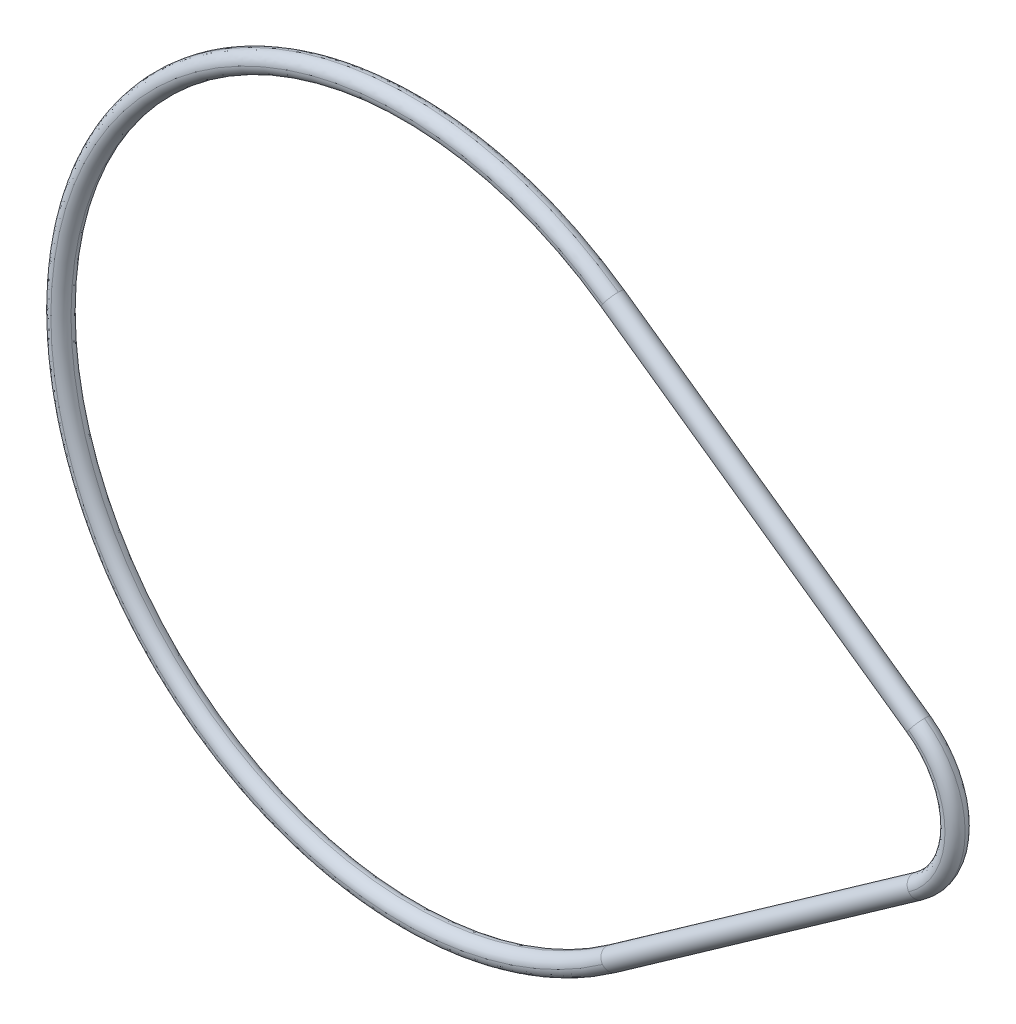
ISO-10303-21;
HEADER;
FILE_DESCRIPTION(('STEP AP214'),'2;1');
FILE_NAME('part.step','',(''),(''),'','','');
FILE_SCHEMA(('AUTOMOTIVE_DESIGN { 1 0 10303 214 1 1 1 1 }'));
ENDSEC;
DATA;
#1=APPLICATION_CONTEXT('core data for automotive mechanical design processes');
#2=APPLICATION_PROTOCOL_DEFINITION('international standard','automotive_design',2000,#1);
#3=PRODUCT_CONTEXT('',#1,'mechanical');
#4=PRODUCT('Part','Part','',(#3));
#5=PRODUCT_RELATED_PRODUCT_CATEGORY('part','',(#4));
#6=PRODUCT_DEFINITION_FORMATION('','',#4);
#7=PRODUCT_DEFINITION_CONTEXT('part definition',#1,'design');
#8=PRODUCT_DEFINITION('design','',#6,#7);
#9=PRODUCT_DEFINITION_SHAPE('','',#8);
#10=(LENGTH_UNIT() NAMED_UNIT(*) SI_UNIT(.MILLI.,.METRE.));
#11=(NAMED_UNIT(*) PLANE_ANGLE_UNIT() SI_UNIT($,.RADIAN.));
#12=(NAMED_UNIT(*) SI_UNIT($,.STERADIAN.) SOLID_ANGLE_UNIT());
#13=UNCERTAINTY_MEASURE_WITH_UNIT(LENGTH_MEASURE(1.E-05),#10,'distance_accuracy_value','');
#14=(GEOMETRIC_REPRESENTATION_CONTEXT(3) GLOBAL_UNCERTAINTY_ASSIGNED_CONTEXT((#13)) GLOBAL_UNIT_ASSIGNED_CONTEXT((#10,
#11,#12)) REPRESENTATION_CONTEXT('',''));
#15=CARTESIAN_POINT('',(0.,0.,0.));
#16=DIRECTION('',(0.,0.,1.));
#17=DIRECTION('',(1.,0.,0.));
#18=AXIS2_PLACEMENT_3D('',#15,#16,#17);
#19=CARTESIAN_POINT('',(35.9999999999998,-4.35415592470179E-13,4.42337322807909E-13));
#20=CARTESIAN_POINT('',(35.9999999999998,-4.3545146154447E-13,0.585786437627345));
#21=CARTESIAN_POINT('',(36.4142135623729,-4.35476824810136E-13,1.00000000000044));
#22=CARTESIAN_POINT('',(36.9999999999998,-4.35476824810136E-13,1.00000000000044));
#23=(BOUNDED_CURVE() B_SPLINE_CURVE(3,(#19,#20,#21,#22),.UNSPECIFIED.,.F.,
.F.) B_SPLINE_CURVE_WITH_KNOTS((4,4),(0.,1.),
.UNSPECIFIED.) CURVE() GEOMETRIC_REPRESENTATION_ITEM() RATIONAL_B_SPLINE_CURVE((1.,
0.804737854124367,0.804737854124367,1.)) REPRESENTATION_ITEM(''));
#24=CARTESIAN_POINT('',(45.5,0.,0.));
#25=DIRECTION('',(0.,0.,-1.));
#26=AXIS1_PLACEMENT('',#24,#25);
#27=SURFACE_OF_REVOLUTION('',#23,#26);
#28=CARTESIAN_POINT('',(45.5,0.,-1.92030235675099E-13));
#29=DIRECTION('',(0.,0.,-1.));
#30=DIRECTION('',(-1.,0.,0.));
#31=AXIS2_PLACEMENT_3D('',#28,#29,#30);
#32=CIRCLE('',#31,9.5000000000006);
#33=CARTESIAN_POINT('',(50.9755494585221,7.76326980929782,0.));
#34=VERTEX_POINT('',#33);
#35=CARTESIAN_POINT('',(50.975549450689,-7.76326981466686,0.));
#36=VERTEX_POINT('',#35);
#37=EDGE_CURVE('E233',#34,#36,#32,.T.);
#38=ORIENTED_EDGE('',*,*,#37,.F.);
#39=CARTESIAN_POINT('',(50.3991758241761,6.94608351834409,4.37540678464507E-13));
#40=DIRECTION('',(0.817186296275724,-0.576373626373696,0.));
#41=DIRECTION('',(0.576373626373693,0.817186296275726,0.));
#42=AXIS2_PLACEMENT_3D('',#39,#40,#41);
#43=CIRCLE('',#42,1.);
#44=CARTESIAN_POINT('',(50.3991758271894,6.94608351597871,1.00000000009366));
#45=VERTEX_POINT('',#44);
#46=EDGE_CURVE('E114',#34,#45,#43,.T.);
#47=ORIENTED_EDGE('',*,*,#46,.T.);
#48=CARTESIAN_POINT('',(45.5,0.,1.));
#49=DIRECTION('',(0.,0.,-1.));
#50=DIRECTION('',(-1.,0.,0.));
#51=AXIS2_PLACEMENT_3D('',#48,#49,#50);
#52=CIRCLE('',#51,8.49999999999956);
#53=CARTESIAN_POINT('',(50.3991758241891,-6.94608351821187,1.00000000004481));
#54=VERTEX_POINT('',#53);
#55=EDGE_CURVE('E126',#54,#45,#52,.F.);
#56=ORIENTED_EDGE('',*,*,#55,.F.);
#57=CARTESIAN_POINT('',(50.3991758241755,-6.94608351834449,4.4109038795075E-13));
#58=DIRECTION('',(0.817186296275836,0.576373626373538,0.));
#59=DIRECTION('',(0.576373626373541,-0.817186296275833,0.));
#60=AXIS2_PLACEMENT_3D('',#57,#58,#59);
#61=CIRCLE('',#60,0.999999999999998);
#62=EDGE_CURVE('E111',#54,#36,#61,.T.);
#63=ORIENTED_EDGE('',*,*,#62,.T.);
#64=EDGE_LOOP('',(#38,#47,#56,#63));
#65=FACE_BOUND('',#64,.T.);
#66=ADVANCED_FACE('F16',(#65),#27,.F.);
#67=CARTESIAN_POINT('',(20.014574175452,28.3767941383865,0.));
#68=DIRECTION('',(-0.817186296275671,0.576373626373771,0.));
#69=DIRECTION('',(-0.576373626373771,-0.817186296275671,0.));
#70=AXIS2_PLACEMENT_3D('',#67,#68,#69);
#71=CYLINDRICAL_SURFACE('',#70,1.00000000001412);
#72=CARTESIAN_POINT('',(20.0145741757996,28.3767941381413,0.));
#73=DIRECTION('',(-0.817186296275672,0.576373626373769,0.));
#74=DIRECTION('',(-0.57637362637377,-0.817186296275672,0.));
#75=AXIS2_PLACEMENT_3D('',#72,#73,#74);
#76=CIRCLE('',#75,1.00000000013567);
#77=CARTESIAN_POINT('',(20.01457417573,28.3767941379995,0.999999999957661));
#78=VERTEX_POINT('',#77);
#79=CARTESIAN_POINT('',(19.4382005494769,27.5596078418945,0.));
#80=VERTEX_POINT('',#79);
#81=EDGE_CURVE('E88',#78,#80,#76,.F.);
#82=ORIENTED_EDGE('',*,*,#81,.T.);
#83=CARTESIAN_POINT('',(20.0145741758809,28.376794138084,0.));
#84=DIRECTION('',(0.817186296276143,-0.576373626373101,0.));
#85=DIRECTION('',(0.5763736263731,0.817186296276144,0.));
#86=AXIS2_PLACEMENT_3D('',#83,#84,#85);
#87=CIRCLE('',#86,0.999999999559293);
#88=CARTESIAN_POINT('',(20.0145741757953,28.3767941380489,-0.999999999813564));
#89=VERTEX_POINT('',#88);
#90=EDGE_CURVE('E100',#80,#89,#87,.T.);
#91=ORIENTED_EDGE('',*,*,#90,.T.);
#92=CARTESIAN_POINT('',(20.0145741758243,28.3767941381762,0.));
#93=DIRECTION('',(-0.817186296275768,0.576373626373633,0.));
#94=DIRECTION('',(0.,0.,-1.));
#95=AXIS2_PLACEMENT_3D('',#92,#93,#94);
#96=CIRCLE('',#95,1.00000000000001);
#97=CARTESIAN_POINT('',(20.5909478021124,29.193980434245,0.));
#98=VERTEX_POINT('',#97);
#99=EDGE_CURVE('E234',#98,#89,#96,.T.);
#100=ORIENTED_EDGE('',*,*,#99,.F.);
#101=CARTESIAN_POINT('',(20.0145741758809,28.376794138084,0.));
#102=DIRECTION('',(0.817186296276143,-0.576373626373101,0.));
#103=DIRECTION('',(0.5763736263731,0.817186296276144,0.));
#104=AXIS2_PLACEMENT_3D('',#101,#102,#103);
#105=CIRCLE('',#104,0.999999999559293);
#106=EDGE_CURVE('E103',#98,#78,#105,.T.);
#107=ORIENTED_EDGE('',*,*,#106,.T.);
#108=EDGE_LOOP('',(#82,#91,#100,#107));
#109=FACE_BOUND('',#108,.T.);
#110=CARTESIAN_POINT('',(50.3991758119882,6.94608352691719,0.));
#111=DIRECTION('',(0.817186296276143,-0.576373626373101,0.));
#112=DIRECTION('',(0.5763736263731,0.817186296276144,0.));
#113=AXIS2_PLACEMENT_3D('',#110,#111,#112);
#114=CIRCLE('',#113,1.00000000058911);
#115=CARTESIAN_POINT('',(50.3991758195627,6.94608352141083,-1.00000000026774));
#116=VERTEX_POINT('',#115);
#117=CARTESIAN_POINT('',(49.8228021947695,6.12889722405691,0.));
#118=VERTEX_POINT('',#117);
#119=EDGE_CURVE('E105',#116,#118,#114,.F.);
#120=ORIENTED_EDGE('',*,*,#119,.T.);
#121=CARTESIAN_POINT('',(50.3991758243119,6.94608351818795,0.));
#122=DIRECTION('',(-0.817186296275672,0.576373626373769,0.));
#123=DIRECTION('',(-0.576373626373767,-0.817186296275674,0.));
#124=AXIS2_PLACEMENT_3D('',#121,#122,#123);
#125=CIRCLE('',#124,0.999999999892656);
#126=EDGE_CURVE('E20',#118,#45,#125,.T.);
#127=ORIENTED_EDGE('',*,*,#126,.T.);
#128=ORIENTED_EDGE('',*,*,#46,.F.);
#129=CARTESIAN_POINT('',(50.3991758363535,6.94608350975573,-1.89672817258016E-13));
#130=DIRECTION('',(0.817186295265293,-0.576373627806292,0.));
#131=DIRECTION('',(0.,0.,-1.));
#132=AXIS2_PLACEMENT_3D('',#129,#130,#131);
#133=CIRCLE('',#132,1.);
#134=EDGE_CURVE('E230',#116,#34,#133,.T.);
#135=ORIENTED_EDGE('',*,*,#134,.F.);
#136=EDGE_LOOP('',(#120,#127,#128,#135));
#137=FACE_BOUND('',#136,.T.);
#138=ADVANCED_FACE('F97',(#109,#137),#71,.T.);
#139=CARTESIAN_POINT('',(37.0000000000004,-4.35476824810136E-13,1.));
#140=CARTESIAN_POINT('',(37.5857864376273,-4.35476824810136E-13,0.999999999999992));
#141=CARTESIAN_POINT('',(38.0000000000004,-4.3545146154447E-13,0.585786437626891));
#142=CARTESIAN_POINT('',(38.0000000000004,-4.35415592470179E-13,0.));
#143=(BOUNDED_CURVE() B_SPLINE_CURVE(3,(#139,#140,#141,#142),.UNSPECIFIED.,.F.,
.F.) B_SPLINE_CURVE_WITH_KNOTS((4,4),(0.,1.),
.UNSPECIFIED.) CURVE() GEOMETRIC_REPRESENTATION_ITEM() RATIONAL_B_SPLINE_CURVE((1.,
0.804737854124365,0.804737854124365,1.)) REPRESENTATION_ITEM(''));
#144=CARTESIAN_POINT('',(45.5,0.,0.));
#145=DIRECTION('',(0.,0.,-1.));
#146=AXIS1_PLACEMENT('',#144,#145);
#147=SURFACE_OF_REVOLUTION('',#143,#146);
#148=ORIENTED_EDGE('',*,*,#55,.T.);
#149=ORIENTED_EDGE('',*,*,#126,.F.);
#150=CARTESIAN_POINT('',(45.5,0.,0.));
#151=DIRECTION('',(0.,0.,-1.));
#152=DIRECTION('',(-1.,0.,0.));
#153=AXIS2_PLACEMENT_3D('',#150,#151,#152);
#154=CIRCLE('',#153,7.5);
#155=CARTESIAN_POINT('',(49.8228022004797,-6.12889722008621,0.));
#156=VERTEX_POINT('',#155);
#157=EDGE_CURVE('E228',#156,#118,#154,.F.);
#158=ORIENTED_EDGE('',*,*,#157,.F.);
#159=CARTESIAN_POINT('',(50.3991758241751,-6.94608351834404,0.));
#160=DIRECTION('',(0.817186296275848,0.576373626373521,0.));
#161=DIRECTION('',(0.,0.,1.));
#162=AXIS2_PLACEMENT_3D('',#159,#160,#161);
#163=CIRCLE('',#162,0.999999999999997);
#164=EDGE_CURVE('E116',#156,#54,#163,.T.);
#165=ORIENTED_EDGE('',*,*,#164,.T.);
#166=EDGE_LOOP('',(#148,#149,#158,#165));
#167=FACE_BOUND('',#166,.T.);
#168=ADVANCED_FACE('F138',(#167),#147,.F.);
#169=CARTESIAN_POINT('',(36.9999999999994,-4.35354360130221E-13,-1.00000000000019));
#170=CARTESIAN_POINT('',(36.4142135623725,-4.35354360130221E-13,-1.00000000000019));
#171=CARTESIAN_POINT('',(35.9999999999994,-4.35379723395887E-13,-0.585786437627097));
#172=CARTESIAN_POINT('',(35.9999999999994,-4.35415592470178E-13,-1.92030235675099E-13));
#173=(BOUNDED_CURVE() B_SPLINE_CURVE(3,(#169,#170,#171,#172),.UNSPECIFIED.,.F.,
.F.) B_SPLINE_CURVE_WITH_KNOTS((4,4),(0.,1.),
.UNSPECIFIED.) CURVE() GEOMETRIC_REPRESENTATION_ITEM() RATIONAL_B_SPLINE_CURVE((1.,
0.804737854124365,0.804737854124365,1.)) REPRESENTATION_ITEM(''));
#174=CARTESIAN_POINT('',(45.5,0.,0.));
#175=DIRECTION('',(0.,0.,-1.));
#176=AXIS1_PLACEMENT('',#174,#175);
#177=SURFACE_OF_REVOLUTION('',#173,#176);
#178=ORIENTED_EDGE('',*,*,#134,.T.);
#179=ORIENTED_EDGE('',*,*,#37,.T.);
#180=CARTESIAN_POINT('',(50.3991758241758,-6.94608351834479,-1.88525720833521E-13));
#181=DIRECTION('',(0.817186296275832,0.576373626373543,0.));
#182=DIRECTION('',(0.,0.,-1.));
#183=AXIS2_PLACEMENT_3D('',#180,#181,#182);
#184=CIRCLE('',#183,1.);
#185=CARTESIAN_POINT('',(50.399175827144,-6.94608351601386,-1.00000000006791));
#186=VERTEX_POINT('',#185);
#187=EDGE_CURVE('E128',#36,#186,#184,.T.);
#188=ORIENTED_EDGE('',*,*,#187,.T.);
#189=CARTESIAN_POINT('',(45.5,0.,-1.));
#190=DIRECTION('',(0.,0.,-1.));
#191=DIRECTION('',(-1.,0.,0.));
#192=AXIS2_PLACEMENT_3D('',#189,#190,#191);
#193=CIRCLE('',#192,8.49999999961749);
#194=EDGE_CURVE('E207',#116,#186,#193,.T.);
#195=ORIENTED_EDGE('',*,*,#194,.F.);
#196=EDGE_LOOP('',(#178,#179,#188,#195));
#197=FACE_BOUND('',#196,.T.);
#198=ADVANCED_FACE('F141',(#197),#177,.F.);
#199=CARTESIAN_POINT('',(38.,0.,0.));
#200=CARTESIAN_POINT('',(38.,0.,-0.585786437626905));
#201=CARTESIAN_POINT('',(37.5857864376269,0.,-1.));
#202=CARTESIAN_POINT('',(37.,0.,-1.));
#203=(BOUNDED_CURVE() B_SPLINE_CURVE(3,(#199,#200,#201,#202),.UNSPECIFIED.,.F.,
.F.) B_SPLINE_CURVE_WITH_KNOTS((4,4),(0.,1.),
.UNSPECIFIED.) CURVE() GEOMETRIC_REPRESENTATION_ITEM() RATIONAL_B_SPLINE_CURVE((1.,
0.804737854124365,0.804737854124365,1.)) REPRESENTATION_ITEM(''));
#204=CARTESIAN_POINT('',(45.5,0.,0.));
#205=DIRECTION('',(0.,0.,-1.));
#206=AXIS1_PLACEMENT('',#204,#205);
#207=SURFACE_OF_REVOLUTION('',#203,#206);
#208=ORIENTED_EDGE('',*,*,#119,.F.);
#209=ORIENTED_EDGE('',*,*,#194,.T.);
#210=CARTESIAN_POINT('',(50.3991758242692,-6.94608351821809,0.));
#211=DIRECTION('',(-0.817186296275672,-0.576373626373769,0.));
#212=DIRECTION('',(0.576373626373769,-0.817186296275673,0.));
#213=AXIS2_PLACEMENT_3D('',#210,#211,#212);
#214=CIRCLE('',#213,1.00000000061949);
#215=EDGE_CURVE('E201',#156,#186,#214,.T.);
#216=ORIENTED_EDGE('',*,*,#215,.F.);
#217=ORIENTED_EDGE('',*,*,#157,.T.);
#218=EDGE_LOOP('',(#208,#209,#216,#217));
#219=FACE_BOUND('',#218,.T.);
#220=ADVANCED_FACE('F216',(#219),#207,.F.);
#221=CARTESIAN_POINT('',(50.3991758241191,-6.94608351791601,0.));
#222=DIRECTION('',(0.817186296276149,0.576373626373093,0.));
#223=DIRECTION('',(-0.576373626373093,0.817186296276149,0.));
#224=AXIS2_PLACEMENT_3D('',#221,#222,#223);
#225=CYLINDRICAL_SURFACE('',#224,0.999999999665433);
#226=CARTESIAN_POINT('',(20.0145741757995,-28.3767941381414,0.));
#227=DIRECTION('',(0.817186296276143,0.576373626373101,0.));
#228=DIRECTION('',(-0.576373626373101,0.817186296276144,0.));
#229=AXIS2_PLACEMENT_3D('',#226,#227,#228);
#230=CIRCLE('',#229,1.00000000013567);
#231=CARTESIAN_POINT('',(20.5909478021613,-29.1939804343583,0.));
#232=VERTEX_POINT('',#231);
#233=CARTESIAN_POINT('',(20.0145741757837,-28.3767941380767,-0.999999999923739));
#234=VERTEX_POINT('',#233);
#235=EDGE_CURVE('E205',#232,#234,#230,.T.);
#236=ORIENTED_EDGE('',*,*,#235,.T.);
#237=CARTESIAN_POINT('',(20.0145741758802,-28.3767941380845,0.));
#238=DIRECTION('',(-0.817186296275672,-0.576373626373769,0.));
#239=DIRECTION('',(0.57637362637377,-0.817186296275672,0.));
#240=AXIS2_PLACEMENT_3D('',#237,#238,#239);
#241=CIRCLE('',#240,0.999999999559294);
#242=CARTESIAN_POINT('',(19.4382005495795,-27.5596078419984,0.));
#243=VERTEX_POINT('',#242);
#244=EDGE_CURVE('E35',#234,#243,#241,.F.);
#245=ORIENTED_EDGE('',*,*,#244,.T.);
#246=CARTESIAN_POINT('',(20.0145741758236,-28.3767941381766,0.));
#247=DIRECTION('',(-0.817186296275781,-0.576373626373616,0.));
#248=DIRECTION('',(1.52655665885959E-13,-2.18575157973078E-13,1.));
#249=AXIS2_PLACEMENT_3D('',#246,#247,#248);
#250=CIRCLE('',#249,0.999999999999998);
#251=CARTESIAN_POINT('',(20.0145741757496,-28.3767941379857,0.999999999722625));
#252=VERTEX_POINT('',#251);
#253=EDGE_CURVE('E90',#252,#243,#250,.T.);
#254=ORIENTED_EDGE('',*,*,#253,.F.);
#255=CARTESIAN_POINT('',(20.0145741758802,-28.3767941380845,0.));
#256=DIRECTION('',(-0.817186296275672,-0.576373626373769,0.));
#257=DIRECTION('',(0.57637362637377,-0.817186296275672,0.));
#258=AXIS2_PLACEMENT_3D('',#255,#256,#257);
#259=CIRCLE('',#258,0.999999999559294);
#260=EDGE_CURVE('E198',#252,#232,#259,.F.);
#261=ORIENTED_EDGE('',*,*,#260,.T.);
#262=EDGE_LOOP('',(#236,#245,#254,#261));
#263=FACE_BOUND('',#262,.T.);
#264=ORIENTED_EDGE('',*,*,#215,.T.);
#265=ORIENTED_EDGE('',*,*,#187,.F.);
#266=ORIENTED_EDGE('',*,*,#62,.F.);
#267=ORIENTED_EDGE('',*,*,#164,.F.);
#268=EDGE_LOOP('',(#264,#265,#266,#267));
#269=FACE_BOUND('',#268,.T.);
#270=ADVANCED_FACE('F189',(#263,#269),#225,.T.);
#271=CARTESIAN_POINT('',(-34.7250000000002,0.,1.));
#272=CARTESIAN_POINT('',(-34.1392135623733,0.,1.00000000000015));
#273=CARTESIAN_POINT('',(-33.7250000000001,0.,0.585786437627168));
#274=CARTESIAN_POINT('',(-33.725,0.,2.62962044571194E-13));
#275=(BOUNDED_CURVE() B_SPLINE_CURVE(3,(#271,#272,#273,#274),.UNSPECIFIED.,.F.,
.F.) B_SPLINE_CURVE_WITH_KNOTS((4,4),(0.,1.),
.UNSPECIFIED.) CURVE() GEOMETRIC_REPRESENTATION_ITEM() RATIONAL_B_SPLINE_CURVE((1.,
0.804737854124365,0.804737854124365,1.)) REPRESENTATION_ITEM(''));
#276=CARTESIAN_POINT('',(0.,0.,0.));
#277=DIRECTION('',(0.,0.,-1.));
#278=AXIS1_PLACEMENT('',#276,#277);
#279=SURFACE_OF_REVOLUTION('',#275,#278);
#280=CARTESIAN_POINT('',(0.,0.,1.));
#281=DIRECTION('',(0.,0.,-1.));
#282=DIRECTION('',(-1.,0.,0.));
#283=AXIS2_PLACEMENT_3D('',#280,#281,#282);
#284=CIRCLE('',#283,34.725);
#285=EDGE_CURVE('E93',#252,#78,#284,.T.);
#286=ORIENTED_EDGE('',*,*,#285,.F.);
#287=ORIENTED_EDGE('',*,*,#253,.T.);
#288=CARTESIAN_POINT('',(0.,0.,0.));
#289=DIRECTION('',(0.,0.,-1.));
#290=DIRECTION('',(-1.,0.,0.));
#291=AXIS2_PLACEMENT_3D('',#288,#289,#290);
#292=CIRCLE('',#291,33.725);
#293=EDGE_CURVE('E84',#80,#243,#292,.F.);
#294=ORIENTED_EDGE('',*,*,#293,.F.);
#295=ORIENTED_EDGE('',*,*,#81,.F.);
#296=EDGE_LOOP('',(#286,#287,#294,#295));
#297=FACE_BOUND('',#296,.T.);
#298=ADVANCED_FACE('F87',(#297),#279,.F.);
#299=CARTESIAN_POINT('',(-35.725,0.,0.));
#300=CARTESIAN_POINT('',(-35.725,0.,0.585786437626905));
#301=CARTESIAN_POINT('',(-35.3107864376269,0.,1.));
#302=CARTESIAN_POINT('',(-34.725,0.,1.));
#303=(BOUNDED_CURVE() B_SPLINE_CURVE(3,(#299,#300,#301,#302),.UNSPECIFIED.,.F.,
.F.) B_SPLINE_CURVE_WITH_KNOTS((4,4),(0.,1.),
.UNSPECIFIED.) CURVE() GEOMETRIC_REPRESENTATION_ITEM() RATIONAL_B_SPLINE_CURVE((1.,
0.804737854124365,0.804737854124365,1.)) REPRESENTATION_ITEM(''));
#304=CARTESIAN_POINT('',(0.,0.,0.));
#305=DIRECTION('',(0.,0.,-1.));
#306=AXIS1_PLACEMENT('',#304,#305);
#307=SURFACE_OF_REVOLUTION('',#303,#306);
#308=CARTESIAN_POINT('',(0.,0.,0.));
#309=DIRECTION('',(0.,0.,-1.));
#310=DIRECTION('',(-1.,0.,0.));
#311=AXIS2_PLACEMENT_3D('',#308,#309,#310);
#312=CIRCLE('',#311,35.7250000000001);
#313=EDGE_CURVE('E26',#232,#98,#312,.T.);
#314=ORIENTED_EDGE('',*,*,#313,.F.);
#315=ORIENTED_EDGE('',*,*,#260,.F.);
#316=ORIENTED_EDGE('',*,*,#285,.T.);
#317=ORIENTED_EDGE('',*,*,#106,.F.);
#318=EDGE_LOOP('',(#314,#315,#316,#317));
#319=FACE_BOUND('',#318,.T.);
#320=ADVANCED_FACE('F157',(#319),#307,.F.);
#321=CARTESIAN_POINT('',(-33.725,0.,0.));
#322=CARTESIAN_POINT('',(-33.725,0.,-0.585786437626901));
#323=CARTESIAN_POINT('',(-34.1392135623731,0.,-0.999999999999994));
#324=CARTESIAN_POINT('',(-34.725,0.,-0.999999999999994));
#325=(BOUNDED_CURVE() B_SPLINE_CURVE(3,(#321,#322,#323,#324),.UNSPECIFIED.,.F.,
.F.) B_SPLINE_CURVE_WITH_KNOTS((4,4),(0.,1.),
.UNSPECIFIED.) CURVE() GEOMETRIC_REPRESENTATION_ITEM() RATIONAL_B_SPLINE_CURVE((1.,
0.804737854124365,0.804737854124365,1.)) REPRESENTATION_ITEM(''));
#326=CARTESIAN_POINT('',(0.,0.,0.));
#327=DIRECTION('',(0.,0.,-1.));
#328=AXIS1_PLACEMENT('',#326,#327);
#329=SURFACE_OF_REVOLUTION('',#325,#328);
#330=ORIENTED_EDGE('',*,*,#293,.T.);
#331=ORIENTED_EDGE('',*,*,#244,.F.);
#332=CARTESIAN_POINT('',(0.,0.,-1.));
#333=DIRECTION('',(0.,0.,-1.));
#334=DIRECTION('',(-1.,0.,0.));
#335=AXIS2_PLACEMENT_3D('',#332,#333,#334);
#336=CIRCLE('',#335,34.725);
#337=EDGE_CURVE('E11',#89,#234,#336,.F.);
#338=ORIENTED_EDGE('',*,*,#337,.F.);
#339=ORIENTED_EDGE('',*,*,#90,.F.);
#340=EDGE_LOOP('',(#330,#331,#338,#339));
#341=FACE_BOUND('',#340,.T.);
#342=ADVANCED_FACE('F104',(#341),#329,.F.);
#343=CARTESIAN_POINT('',(-34.725,0.,-1.));
#344=CARTESIAN_POINT('',(-35.310786437627,0.,-1.));
#345=CARTESIAN_POINT('',(-35.725,0.,-0.585786437626912));
#346=CARTESIAN_POINT('',(-35.7250000000001,0.,0.));
#347=(BOUNDED_CURVE() B_SPLINE_CURVE(3,(#343,#344,#345,#346),.UNSPECIFIED.,.F.,
.F.) B_SPLINE_CURVE_WITH_KNOTS((4,4),(0.,1.),
.UNSPECIFIED.) CURVE() GEOMETRIC_REPRESENTATION_ITEM() RATIONAL_B_SPLINE_CURVE((1.,
0.804737854124365,0.804737854124365,1.)) REPRESENTATION_ITEM(''));
#348=CARTESIAN_POINT('',(0.,0.,0.));
#349=DIRECTION('',(0.,0.,-1.));
#350=AXIS1_PLACEMENT('',#348,#349);
#351=SURFACE_OF_REVOLUTION('',#347,#350);
#352=ORIENTED_EDGE('',*,*,#337,.T.);
#353=ORIENTED_EDGE('',*,*,#235,.F.);
#354=ORIENTED_EDGE('',*,*,#313,.T.);
#355=ORIENTED_EDGE('',*,*,#99,.T.);
#356=EDGE_LOOP('',(#352,#353,#354,#355));
#357=FACE_BOUND('',#356,.T.);
#358=ADVANCED_FACE('F150',(#357),#351,.F.);
#359=CLOSED_SHELL('',(#66,#138,#168,#198,#220,#270,#298,#320,#342,#358));
#360=MANIFOLD_SOLID_BREP('B1',#359);
#361=ADVANCED_BREP_SHAPE_REPRESENTATION('',(#18,#360),#14);
#362=SHAPE_DEFINITION_REPRESENTATION(#9,#361);
ENDSEC;
END-ISO-10303-21;
